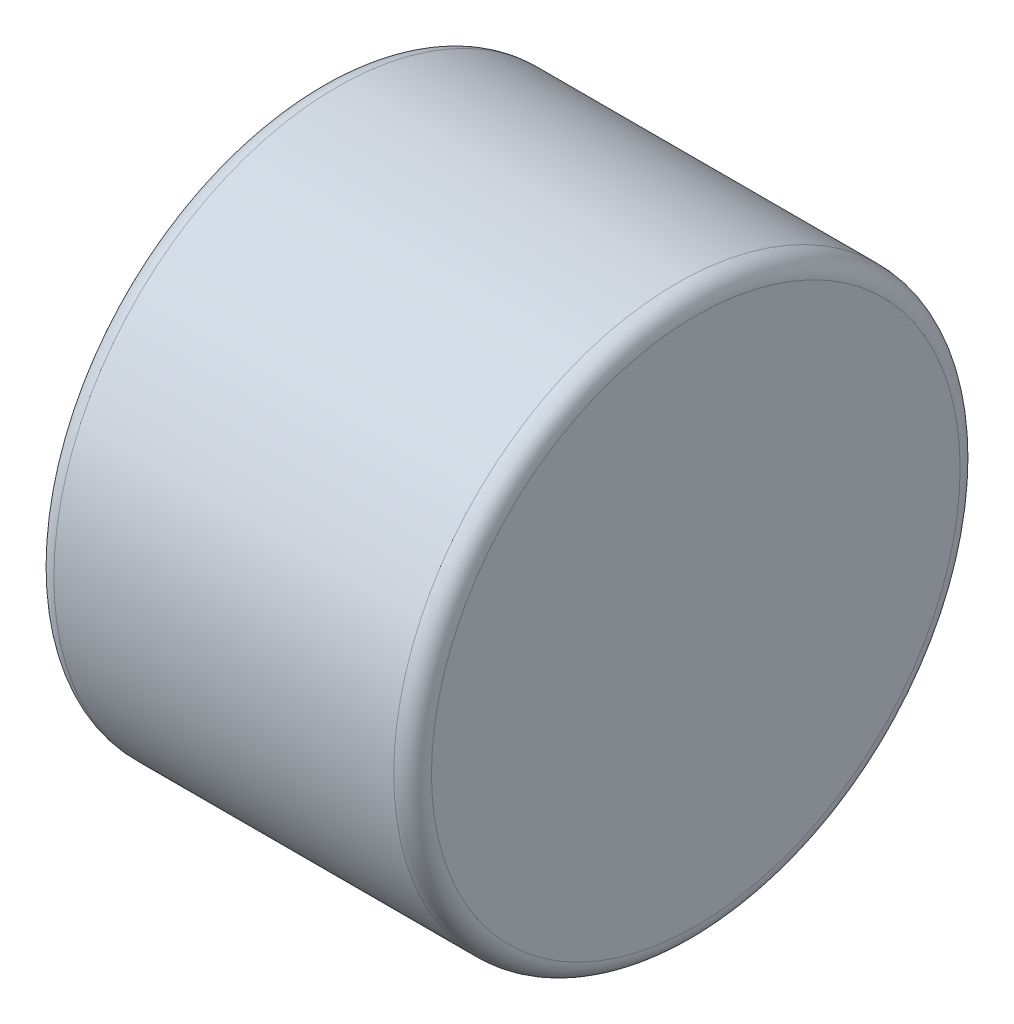
ISO-10303-21;
HEADER;
FILE_DESCRIPTION(('STEP AP214'),'2;1');
FILE_NAME('part.step','',(''),(''),'','','');
FILE_SCHEMA(('AUTOMOTIVE_DESIGN { 1 0 10303 214 1 1 1 1 }'));
ENDSEC;
DATA;
#1=APPLICATION_CONTEXT('core data for automotive mechanical design processes');
#2=APPLICATION_PROTOCOL_DEFINITION('international standard','automotive_design',2000,#1);
#3=PRODUCT_CONTEXT('',#1,'mechanical');
#4=PRODUCT('Part','Part','',(#3));
#5=PRODUCT_RELATED_PRODUCT_CATEGORY('part','',(#4));
#6=PRODUCT_DEFINITION_FORMATION('','',#4);
#7=PRODUCT_DEFINITION_CONTEXT('part definition',#1,'design');
#8=PRODUCT_DEFINITION('design','',#6,#7);
#9=PRODUCT_DEFINITION_SHAPE('','',#8);
#10=(LENGTH_UNIT() NAMED_UNIT(*) SI_UNIT(.MILLI.,.METRE.));
#11=(NAMED_UNIT(*) PLANE_ANGLE_UNIT() SI_UNIT($,.RADIAN.));
#12=(NAMED_UNIT(*) SI_UNIT($,.STERADIAN.) SOLID_ANGLE_UNIT());
#13=UNCERTAINTY_MEASURE_WITH_UNIT(LENGTH_MEASURE(1.E-05),#10,'distance_accuracy_value','');
#14=(GEOMETRIC_REPRESENTATION_CONTEXT(3) GLOBAL_UNCERTAINTY_ASSIGNED_CONTEXT((#13)) GLOBAL_UNIT_ASSIGNED_CONTEXT((#10,
#11,#12)) REPRESENTATION_CONTEXT('',''));
#15=CARTESIAN_POINT('',(0.,0.,0.));
#16=DIRECTION('',(0.,0.,1.));
#17=DIRECTION('',(1.,0.,0.));
#18=AXIS2_PLACEMENT_3D('',#15,#16,#17);
#19=CARTESIAN_POINT('',(2.,0.,0.));
#20=DIRECTION('',(-1.,0.,0.));
#21=DIRECTION('',(0.,0.,1.));
#22=AXIS2_PLACEMENT_3D('',#19,#20,#21);
#23=CYLINDRICAL_SURFACE('',#22,3.);
#24=CARTESIAN_POINT('',(1.8,0.,0.));
#25=DIRECTION('',(1.,0.,0.));
#26=DIRECTION('',(0.,0.,-1.));
#27=AXIS2_PLACEMENT_3D('',#24,#25,#26);
#28=CIRCLE('',#27,3.);
#29=CARTESIAN_POINT('',(1.8,0.,-3.));
#30=VERTEX_POINT('',#29);
#31=EDGE_CURVE('E46',#30,#30,#28,.F.);
#32=ORIENTED_EDGE('',*,*,#31,.T.);
#33=EDGE_LOOP('',(#32));
#34=FACE_BOUND('',#33,.T.);
#35=CARTESIAN_POINT('',(-1.8,0.,0.));
#36=DIRECTION('',(1.,0.,0.));
#37=DIRECTION('',(0.,0.,-1.));
#38=AXIS2_PLACEMENT_3D('',#35,#36,#37);
#39=CIRCLE('',#38,3.);
#40=CARTESIAN_POINT('',(-1.8,0.,-3.));
#41=VERTEX_POINT('',#40);
#42=EDGE_CURVE('E50',#41,#41,#39,.T.);
#43=ORIENTED_EDGE('',*,*,#42,.T.);
#44=EDGE_LOOP('',(#43));
#45=FACE_BOUND('',#44,.T.);
#46=ADVANCED_FACE('F39',(#34,#45),#23,.T.);
#47=CARTESIAN_POINT('',(2.,0.,0.));
#48=DIRECTION('',(1.,0.,0.));
#49=DIRECTION('',(0.,0.,-1.));
#50=AXIS2_PLACEMENT_3D('',#47,#48,#49);
#51=PLANE('',#50);
#52=CARTESIAN_POINT('',(2.,0.,0.));
#53=DIRECTION('',(1.,0.,0.));
#54=DIRECTION('',(0.,0.,-1.));
#55=AXIS2_PLACEMENT_3D('',#52,#53,#54);
#56=CIRCLE('',#55,2.8);
#57=CARTESIAN_POINT('',(2.,0.,-2.8));
#58=VERTEX_POINT('',#57);
#59=EDGE_CURVE('E54',#58,#58,#56,.T.);
#60=ORIENTED_EDGE('',*,*,#59,.T.);
#61=EDGE_LOOP('',(#60));
#62=FACE_BOUND('',#61,.T.);
#63=ADVANCED_FACE('F60',(#62),#51,.T.);
#64=CARTESIAN_POINT('',(-2.,0.,0.));
#65=DIRECTION('',(1.,0.,0.));
#66=DIRECTION('',(0.,0.,-1.));
#67=AXIS2_PLACEMENT_3D('',#64,#65,#66);
#68=PLANE('',#67);
#69=CARTESIAN_POINT('',(-2.,0.,0.));
#70=DIRECTION('',(1.,0.,0.));
#71=DIRECTION('',(0.,0.,-1.));
#72=AXIS2_PLACEMENT_3D('',#69,#70,#71);
#73=CIRCLE('',#72,2.8);
#74=CARTESIAN_POINT('',(-2.,0.,-2.8));
#75=VERTEX_POINT('',#74);
#76=EDGE_CURVE('E10',#75,#75,#73,.F.);
#77=ORIENTED_EDGE('',*,*,#76,.T.);
#78=EDGE_LOOP('',(#77));
#79=FACE_BOUND('',#78,.T.);
#80=ADVANCED_FACE('F64',(#79),#68,.F.);
#81=CARTESIAN_POINT('',(1.8,0.,0.));
#82=DIRECTION('',(1.,0.,0.));
#83=DIRECTION('',(0.,0.,-1.));
#84=AXIS2_PLACEMENT_3D('',#81,#82,#83);
#85=TOROIDAL_SURFACE('',#84,2.8,0.2);
#86=ORIENTED_EDGE('',*,*,#31,.F.);
#87=EDGE_LOOP('',(#86));
#88=FACE_BOUND('',#87,.T.);
#89=ORIENTED_EDGE('',*,*,#59,.F.);
#90=EDGE_LOOP('',(#89));
#91=FACE_BOUND('',#90,.T.);
#92=ADVANCED_FACE('F62',(#88,#91),#85,.T.);
#93=CARTESIAN_POINT('',(-1.8,0.,0.));
#94=DIRECTION('',(1.,0.,0.));
#95=DIRECTION('',(0.,0.,-1.));
#96=AXIS2_PLACEMENT_3D('',#93,#94,#95);
#97=TOROIDAL_SURFACE('',#96,2.8,0.2);
#98=ORIENTED_EDGE('',*,*,#76,.F.);
#99=EDGE_LOOP('',(#98));
#100=FACE_BOUND('',#99,.T.);
#101=ORIENTED_EDGE('',*,*,#42,.F.);
#102=EDGE_LOOP('',(#101));
#103=FACE_BOUND('',#102,.T.);
#104=ADVANCED_FACE('F41',(#100,#103),#97,.T.);
#105=CLOSED_SHELL('',(#46,#63,#80,#92,#104));
#106=MANIFOLD_SOLID_BREP('B2',#105);
#107=ADVANCED_BREP_SHAPE_REPRESENTATION('',(#18,#106),#14);
#108=SHAPE_DEFINITION_REPRESENTATION(#9,#107);
ENDSEC;
END-ISO-10303-21;
